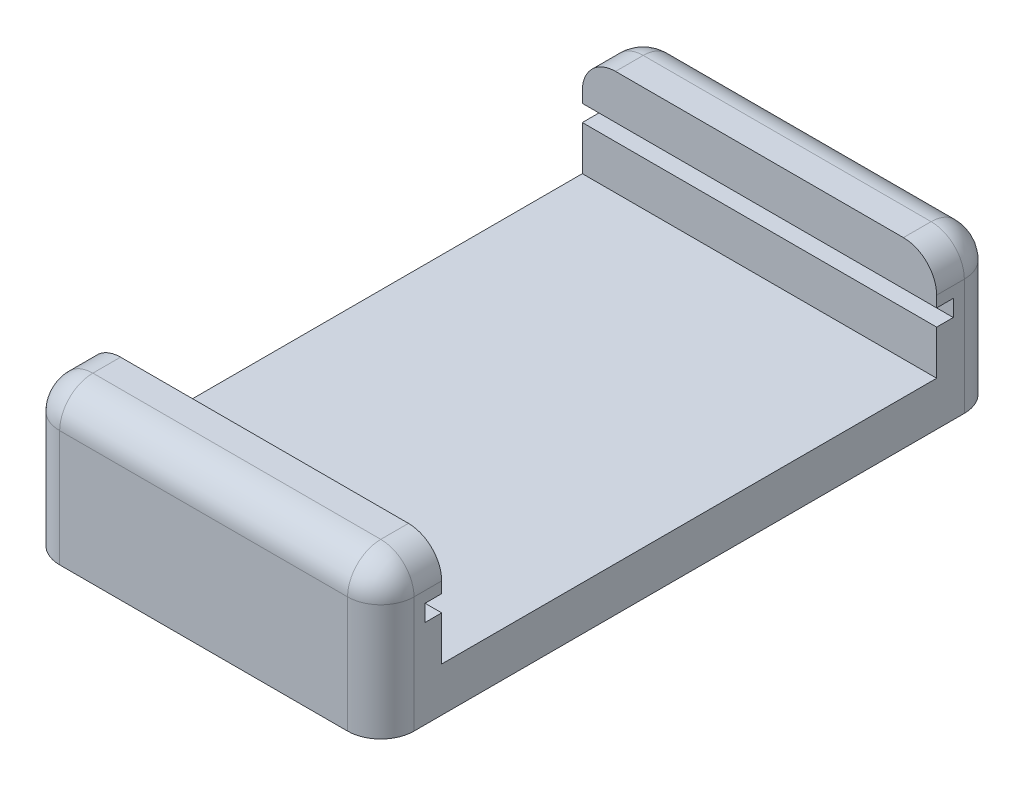
ISO-10303-21;
HEADER;
FILE_DESCRIPTION(('STEP AP214'),'2;1');
FILE_NAME('part.step','',(''),(''),'','','');
FILE_SCHEMA(('AUTOMOTIVE_DESIGN { 1 0 10303 214 1 1 1 1 }'));
ENDSEC;
DATA;
#1=APPLICATION_CONTEXT('core data for automotive mechanical design processes');
#2=APPLICATION_PROTOCOL_DEFINITION('international standard','automotive_design',2000,#1);
#3=PRODUCT_CONTEXT('',#1,'mechanical');
#4=PRODUCT('Part','Part','',(#3));
#5=PRODUCT_RELATED_PRODUCT_CATEGORY('part','',(#4));
#6=PRODUCT_DEFINITION_FORMATION('','',#4);
#7=PRODUCT_DEFINITION_CONTEXT('part definition',#1,'design');
#8=PRODUCT_DEFINITION('design','',#6,#7);
#9=PRODUCT_DEFINITION_SHAPE('','',#8);
#10=(LENGTH_UNIT() NAMED_UNIT(*) SI_UNIT(.MILLI.,.METRE.));
#11=(NAMED_UNIT(*) PLANE_ANGLE_UNIT() SI_UNIT($,.RADIAN.));
#12=(NAMED_UNIT(*) SI_UNIT($,.STERADIAN.) SOLID_ANGLE_UNIT());
#13=UNCERTAINTY_MEASURE_WITH_UNIT(LENGTH_MEASURE(1.E-05),#10,'distance_accuracy_value','');
#14=(GEOMETRIC_REPRESENTATION_CONTEXT(3) GLOBAL_UNCERTAINTY_ASSIGNED_CONTEXT((#13)) GLOBAL_UNIT_ASSIGNED_CONTEXT((#10,
#11,#12)) REPRESENTATION_CONTEXT('',''));
#15=CARTESIAN_POINT('',(0.,0.,0.));
#16=DIRECTION('',(0.,0.,1.));
#17=DIRECTION('',(1.,0.,0.));
#18=AXIS2_PLACEMENT_3D('',#15,#16,#17);
#19=CARTESIAN_POINT('',(64.77,0.,0.));
#20=DIRECTION('',(-1.,0.,0.));
#21=DIRECTION('',(0.,0.,1.));
#22=AXIS2_PLACEMENT_3D('',#19,#20,#21);
#23=PLANE('',#22);
#24=DIRECTION('',(0.,-1.,0.));
#25=VECTOR('',#24,1.);
#26=CARTESIAN_POINT('',(64.77,0.,-86.106));
#27=LINE('',#26,#25);
#28=CARTESIAN_POINT('',(64.77,19.3294,-86.106));
#29=VERTEX_POINT('',#28);
#30=CARTESIAN_POINT('',(64.77,18.0594,-86.106));
#31=VERTEX_POINT('',#30);
#32=EDGE_CURVE('E276',#29,#31,#27,.T.);
#33=ORIENTED_EDGE('',*,*,#32,.F.);
#34=DIRECTION('',(0.,0.,1.));
#35=VECTOR('',#34,1.);
#36=CARTESIAN_POINT('',(64.77,19.3294,-82.931));
#37=LINE('',#36,#35);
#38=CARTESIAN_POINT('',(64.77,19.3294,-82.931));
#39=VERTEX_POINT('',#38);
#40=EDGE_CURVE('E393',#29,#39,#37,.T.);
#41=ORIENTED_EDGE('',*,*,#40,.T.);
#42=DIRECTION('',(0.,1.,0.));
#43=VECTOR('',#42,1.);
#44=CARTESIAN_POINT('',(64.77,0.,-82.931));
#45=LINE('',#44,#43);
#46=CARTESIAN_POINT('',(64.77,5.9944,-82.931));
#47=VERTEX_POINT('',#46);
#48=EDGE_CURVE('E390',#39,#47,#45,.F.);
#49=ORIENTED_EDGE('',*,*,#48,.T.);
#50=DIRECTION('',(0.,0.,-1.));
#51=VECTOR('',#50,1.);
#52=CARTESIAN_POINT('',(64.77,5.9944,0.));
#53=LINE('',#52,#51);
#54=CARTESIAN_POINT('',(64.77,5.9944,-146.05));
#55=VERTEX_POINT('',#54);
#56=EDGE_CURVE('E320',#47,#55,#53,.T.);
#57=ORIENTED_EDGE('',*,*,#56,.T.);
#58=DIRECTION('',(0.,1.,0.));
#59=VECTOR('',#58,1.);
#60=CARTESIAN_POINT('',(64.77,19.3294,-146.05));
#61=LINE('',#60,#59);
#62=CARTESIAN_POINT('',(64.77,19.3294,-146.05));
#63=VERTEX_POINT('',#62);
#64=EDGE_CURVE('E385',#55,#63,#61,.T.);
#65=ORIENTED_EDGE('',*,*,#64,.T.);
#66=DIRECTION('',(0.,0.,1.));
#67=VECTOR('',#66,1.);
#68=CARTESIAN_POINT('',(64.77,19.3294,-142.875));
#69=LINE('',#68,#67);
#70=CARTESIAN_POINT('',(64.77,19.3294,-142.875));
#71=VERTEX_POINT('',#70);
#72=EDGE_CURVE('E387',#63,#71,#69,.T.);
#73=ORIENTED_EDGE('',*,*,#72,.T.);
#74=DIRECTION('',(0.,-1.,0.));
#75=VECTOR('',#74,1.);
#76=CARTESIAN_POINT('',(64.77,0.,-142.875));
#77=LINE('',#76,#75);
#78=CARTESIAN_POINT('',(64.77,18.0594,-142.875));
#79=VERTEX_POINT('',#78);
#80=EDGE_CURVE('E316',#71,#79,#77,.T.);
#81=ORIENTED_EDGE('',*,*,#80,.T.);
#82=DIRECTION('',(0.,0.,1.));
#83=VECTOR('',#82,1.);
#84=CARTESIAN_POINT('',(64.77,18.0594,0.));
#85=LINE('',#84,#83);
#86=CARTESIAN_POINT('',(64.77,18.0594,-144.78));
#87=VERTEX_POINT('',#86);
#88=EDGE_CURVE('E300',#87,#79,#85,.T.);
#89=ORIENTED_EDGE('',*,*,#88,.F.);
#90=DIRECTION('',(0.,-1.,0.));
#91=VECTOR('',#90,1.);
#92=CARTESIAN_POINT('',(64.77,0.,-144.78));
#93=LINE('',#92,#91);
#94=CARTESIAN_POINT('',(64.77,16.1544,-144.78));
#95=VERTEX_POINT('',#94);
#96=EDGE_CURVE('E317',#87,#95,#93,.T.);
#97=ORIENTED_EDGE('',*,*,#96,.T.);
#98=DIRECTION('',(0.,0.,1.));
#99=VECTOR('',#98,1.);
#100=CARTESIAN_POINT('',(64.77,16.1544,0.));
#101=LINE('',#100,#99);
#102=CARTESIAN_POINT('',(64.77,16.1544,-142.875));
#103=VERTEX_POINT('',#102);
#104=EDGE_CURVE('E307',#95,#103,#101,.T.);
#105=ORIENTED_EDGE('',*,*,#104,.T.);
#106=CARTESIAN_POINT('',(64.77,11.0744,-142.875));
#107=VERTEX_POINT('',#106);
#108=EDGE_CURVE('E313',#103,#107,#77,.T.);
#109=ORIENTED_EDGE('',*,*,#108,.T.);
#110=DIRECTION('',(0.,0.,1.));
#111=VECTOR('',#110,1.);
#112=CARTESIAN_POINT('',(64.77,11.0744,0.));
#113=LINE('',#112,#111);
#114=CARTESIAN_POINT('',(64.77,11.0744,-86.106));
#115=VERTEX_POINT('',#114);
#116=EDGE_CURVE('E310',#107,#115,#113,.T.);
#117=ORIENTED_EDGE('',*,*,#116,.T.);
#118=CARTESIAN_POINT('',(64.77,16.1544,-86.106));
#119=VERTEX_POINT('',#118);
#120=EDGE_CURVE('E306',#119,#115,#27,.T.);
#121=ORIENTED_EDGE('',*,*,#120,.F.);
#122=CARTESIAN_POINT('',(64.77,16.1544,-84.201));
#123=VERTEX_POINT('',#122);
#124=EDGE_CURVE('E303',#119,#123,#101,.T.);
#125=ORIENTED_EDGE('',*,*,#124,.T.);
#126=DIRECTION('',(0.,-1.,0.));
#127=VECTOR('',#126,1.);
#128=CARTESIAN_POINT('',(64.77,0.,-84.201));
#129=LINE('',#128,#127);
#130=CARTESIAN_POINT('',(64.77,18.0594,-84.201));
#131=VERTEX_POINT('',#130);
#132=EDGE_CURVE('E299',#131,#123,#129,.T.);
#133=ORIENTED_EDGE('',*,*,#132,.F.);
#134=EDGE_CURVE('E241',#31,#131,#85,.T.);
#135=ORIENTED_EDGE('',*,*,#134,.F.);
#136=EDGE_LOOP('',(#33,#41,#49,#57,#65,#73,#81,#89,#97,#105,#109,#117,#121,#125,#133,#135));
#137=FACE_BOUND('',#136,.T.);
#138=ADVANCED_FACE('F41',(#137),#23,.F.);
#139=CARTESIAN_POINT('',(24.13,0.,0.));
#140=DIRECTION('',(-1.,0.,0.));
#141=DIRECTION('',(0.,0.,1.));
#142=AXIS2_PLACEMENT_3D('',#139,#140,#141);
#143=PLANE('',#142);
#144=DIRECTION('',(0.,1.,0.));
#145=VECTOR('',#144,1.);
#146=CARTESIAN_POINT('',(24.13,19.3294,-82.931));
#147=LINE('',#146,#145);
#148=CARTESIAN_POINT('',(24.13,5.9944,-82.931));
#149=VERTEX_POINT('',#148);
#150=CARTESIAN_POINT('',(24.13,19.3294,-82.931));
#151=VERTEX_POINT('',#150);
#152=EDGE_CURVE('E373',#149,#151,#147,.T.);
#153=ORIENTED_EDGE('',*,*,#152,.T.);
#154=DIRECTION('',(0.,0.,1.));
#155=VECTOR('',#154,1.);
#156=CARTESIAN_POINT('',(24.13,19.3294,0.));
#157=LINE('',#156,#155);
#158=CARTESIAN_POINT('',(24.13,19.3294,-86.106));
#159=VERTEX_POINT('',#158);
#160=EDGE_CURVE('E375',#151,#159,#157,.F.);
#161=ORIENTED_EDGE('',*,*,#160,.T.);
#162=DIRECTION('',(0.,-1.,0.));
#163=VECTOR('',#162,1.);
#164=CARTESIAN_POINT('',(24.13,0.,-86.106));
#165=LINE('',#164,#163);
#166=CARTESIAN_POINT('',(24.13,18.0594,-86.106));
#167=VERTEX_POINT('',#166);
#168=EDGE_CURVE('E286',#159,#167,#165,.T.);
#169=ORIENTED_EDGE('',*,*,#168,.T.);
#170=DIRECTION('',(0.,0.,1.));
#171=VECTOR('',#170,1.);
#172=CARTESIAN_POINT('',(24.13,18.0594,0.));
#173=LINE('',#172,#171);
#174=CARTESIAN_POINT('',(24.13,18.0594,-84.201));
#175=VERTEX_POINT('',#174);
#176=EDGE_CURVE('E272',#167,#175,#173,.T.);
#177=ORIENTED_EDGE('',*,*,#176,.T.);
#178=DIRECTION('',(0.,-1.,0.));
#179=VECTOR('',#178,1.);
#180=CARTESIAN_POINT('',(24.13,0.,-84.201));
#181=LINE('',#180,#179);
#182=CARTESIAN_POINT('',(24.13,16.1544,-84.201));
#183=VERTEX_POINT('',#182);
#184=EDGE_CURVE('E275',#175,#183,#181,.T.);
#185=ORIENTED_EDGE('',*,*,#184,.T.);
#186=DIRECTION('',(0.,0.,1.));
#187=VECTOR('',#186,1.);
#188=CARTESIAN_POINT('',(24.13,16.1544,0.));
#189=LINE('',#188,#187);
#190=CARTESIAN_POINT('',(24.13,16.1544,-86.106));
#191=VERTEX_POINT('',#190);
#192=EDGE_CURVE('E279',#191,#183,#189,.T.);
#193=ORIENTED_EDGE('',*,*,#192,.F.);
#194=CARTESIAN_POINT('',(24.13,11.0744,-86.106));
#195=VERTEX_POINT('',#194);
#196=EDGE_CURVE('E282',#191,#195,#165,.T.);
#197=ORIENTED_EDGE('',*,*,#196,.T.);
#198=DIRECTION('',(0.,0.,1.));
#199=VECTOR('',#198,1.);
#200=CARTESIAN_POINT('',(24.13,11.0744,0.));
#201=LINE('',#200,#199);
#202=CARTESIAN_POINT('',(24.13,11.0744,-142.875));
#203=VERTEX_POINT('',#202);
#204=EDGE_CURVE('E285',#203,#195,#201,.T.);
#205=ORIENTED_EDGE('',*,*,#204,.F.);
#206=DIRECTION('',(0.,-1.,0.));
#207=VECTOR('',#206,1.);
#208=CARTESIAN_POINT('',(24.13,0.,-142.875));
#209=LINE('',#208,#207);
#210=CARTESIAN_POINT('',(24.13,16.1544,-142.875));
#211=VERTEX_POINT('',#210);
#212=EDGE_CURVE('E289',#211,#203,#209,.T.);
#213=ORIENTED_EDGE('',*,*,#212,.F.);
#214=CARTESIAN_POINT('',(24.13,16.1544,-144.78));
#215=VERTEX_POINT('',#214);
#216=EDGE_CURVE('E283',#215,#211,#189,.T.);
#217=ORIENTED_EDGE('',*,*,#216,.F.);
#218=DIRECTION('',(0.,-1.,0.));
#219=VECTOR('',#218,1.);
#220=CARTESIAN_POINT('',(24.13,0.,-144.78));
#221=LINE('',#220,#219);
#222=CARTESIAN_POINT('',(24.13,18.0594,-144.78));
#223=VERTEX_POINT('',#222);
#224=EDGE_CURVE('E293',#223,#215,#221,.T.);
#225=ORIENTED_EDGE('',*,*,#224,.F.);
#226=CARTESIAN_POINT('',(24.13,18.0594,-142.875));
#227=VERTEX_POINT('',#226);
#228=EDGE_CURVE('E277',#223,#227,#173,.T.);
#229=ORIENTED_EDGE('',*,*,#228,.T.);
#230=CARTESIAN_POINT('',(24.13,19.3294,-142.875));
#231=VERTEX_POINT('',#230);
#232=EDGE_CURVE('E292',#231,#227,#209,.T.);
#233=ORIENTED_EDGE('',*,*,#232,.F.);
#234=DIRECTION('',(0.,0.,1.));
#235=VECTOR('',#234,1.);
#236=CARTESIAN_POINT('',(24.13,19.3294,0.));
#237=LINE('',#236,#235);
#238=CARTESIAN_POINT('',(24.13,19.3294,-146.05));
#239=VERTEX_POINT('',#238);
#240=EDGE_CURVE('E371',#231,#239,#237,.F.);
#241=ORIENTED_EDGE('',*,*,#240,.T.);
#242=DIRECTION('',(0.,1.,0.));
#243=VECTOR('',#242,1.);
#244=CARTESIAN_POINT('',(24.13,0.,-146.05));
#245=LINE('',#244,#243);
#246=CARTESIAN_POINT('',(24.13,5.9944,-146.05));
#247=VERTEX_POINT('',#246);
#248=EDGE_CURVE('E369',#239,#247,#245,.F.);
#249=ORIENTED_EDGE('',*,*,#248,.T.);
#250=DIRECTION('',(0.,0.,-1.));
#251=VECTOR('',#250,1.);
#252=CARTESIAN_POINT('',(24.13,5.9944,0.));
#253=LINE('',#252,#251);
#254=EDGE_CURVE('E208',#149,#247,#253,.T.);
#255=ORIENTED_EDGE('',*,*,#254,.F.);
#256=EDGE_LOOP('',(#153,#161,#169,#177,#185,#193,#197,#205,#213,#217,#225,#229,#233,#241,#249,#255));
#257=FACE_BOUND('',#256,.T.);
#258=ADVANCED_FACE('F452',(#257),#143,.T.);
#259=CARTESIAN_POINT('',(24.13,0.,-86.106));
#260=DIRECTION('',(0.,0.,1.));
#261=DIRECTION('',(1.,0.,0.));
#262=AXIS2_PLACEMENT_3D('',#259,#260,#261);
#263=PLANE('',#262);
#264=ORIENTED_EDGE('',*,*,#168,.F.);
#265=CARTESIAN_POINT('',(27.94,19.3294,-86.106));
#266=DIRECTION('',(0.,0.,1.));
#267=DIRECTION('',(1.,0.,0.));
#268=AXIS2_PLACEMENT_3D('',#265,#266,#267);
#269=CIRCLE('',#268,3.81);
#270=CARTESIAN_POINT('',(27.94,23.1394,-86.106));
#271=VERTEX_POINT('',#270);
#272=EDGE_CURVE('E379',#159,#271,#269,.F.);
#273=ORIENTED_EDGE('',*,*,#272,.T.);
#274=DIRECTION('',(1.,0.,0.));
#275=VECTOR('',#274,1.);
#276=CARTESIAN_POINT('',(24.13,23.1394,-86.106));
#277=LINE('',#276,#275);
#278=CARTESIAN_POINT('',(60.96,23.1394,-86.106));
#279=VERTEX_POINT('',#278);
#280=EDGE_CURVE('E326',#271,#279,#277,.T.);
#281=ORIENTED_EDGE('',*,*,#280,.T.);
#282=CARTESIAN_POINT('',(60.96,19.3294,-86.106));
#283=DIRECTION('',(0.,0.,1.));
#284=DIRECTION('',(1.,0.,0.));
#285=AXIS2_PLACEMENT_3D('',#282,#283,#284);
#286=CIRCLE('',#285,3.81);
#287=EDGE_CURVE('E377',#279,#29,#286,.F.);
#288=ORIENTED_EDGE('',*,*,#287,.T.);
#289=ORIENTED_EDGE('',*,*,#32,.T.);
#290=DIRECTION('',(1.,0.,0.));
#291=VECTOR('',#290,1.);
#292=CARTESIAN_POINT('',(24.13,18.0594,-86.106));
#293=LINE('',#292,#291);
#294=EDGE_CURVE('E323',#167,#31,#293,.T.);
#295=ORIENTED_EDGE('',*,*,#294,.F.);
#296=EDGE_LOOP('',(#264,#273,#281,#288,#289,#295));
#297=FACE_BOUND('',#296,.T.);
#298=ADVANCED_FACE('F436',(#297),#263,.F.);
#299=CARTESIAN_POINT('',(24.13,23.1394,0.));
#300=DIRECTION('',(0.,1.,0.));
#301=DIRECTION('',(0.,0.,1.));
#302=AXIS2_PLACEMENT_3D('',#299,#300,#301);
#303=PLANE('',#302);
#304=ORIENTED_EDGE('',*,*,#280,.F.);
#305=DIRECTION('',(0.,0.,1.));
#306=VECTOR('',#305,1.);
#307=CARTESIAN_POINT('',(27.94,23.1394,0.));
#308=LINE('',#307,#306);
#309=CARTESIAN_POINT('',(27.94,23.1394,-82.931));
#310=VERTEX_POINT('',#309);
#311=EDGE_CURVE('E366',#271,#310,#308,.T.);
#312=ORIENTED_EDGE('',*,*,#311,.T.);
#313=DIRECTION('',(1.,0.,0.));
#314=VECTOR('',#313,1.);
#315=CARTESIAN_POINT('',(64.77,23.1394,-82.931));
#316=LINE('',#315,#314);
#317=CARTESIAN_POINT('',(60.96,23.1394,-82.931));
#318=VERTEX_POINT('',#317);
#319=EDGE_CURVE('E353',#310,#318,#316,.T.);
#320=ORIENTED_EDGE('',*,*,#319,.T.);
#321=DIRECTION('',(0.,0.,1.));
#322=VECTOR('',#321,1.);
#323=CARTESIAN_POINT('',(60.96,23.1394,-86.106));
#324=LINE('',#323,#322);
#325=EDGE_CURVE('E364',#318,#279,#324,.F.);
#326=ORIENTED_EDGE('',*,*,#325,.T.);
#327=EDGE_LOOP('',(#304,#312,#320,#326));
#328=FACE_BOUND('',#327,.T.);
#329=ADVANCED_FACE('F432',(#328),#303,.T.);
#330=CARTESIAN_POINT('',(24.13,0.,-79.121));
#331=DIRECTION('',(0.,0.,-1.));
#332=DIRECTION('',(-1.,0.,0.));
#333=AXIS2_PLACEMENT_3D('',#330,#331,#332);
#334=PLANE('',#333);
#335=DIRECTION('',(1.,0.,0.));
#336=VECTOR('',#335,1.);
#337=CARTESIAN_POINT('',(24.13,19.3294,-79.121));
#338=LINE('',#337,#336);
#339=CARTESIAN_POINT('',(60.96,19.3294,-79.121));
#340=VERTEX_POINT('',#339);
#341=CARTESIAN_POINT('',(27.94,19.3294,-79.121));
#342=VERTEX_POINT('',#341);
#343=EDGE_CURVE('E356',#340,#342,#338,.F.);
#344=ORIENTED_EDGE('',*,*,#343,.T.);
#345=DIRECTION('',(0.,1.,0.));
#346=VECTOR('',#345,1.);
#347=CARTESIAN_POINT('',(27.94,5.9944,-79.121));
#348=LINE('',#347,#346);
#349=CARTESIAN_POINT('',(27.94,5.9944,-79.121));
#350=VERTEX_POINT('',#349);
#351=EDGE_CURVE('E222',#342,#350,#348,.F.);
#352=ORIENTED_EDGE('',*,*,#351,.T.);
#353=DIRECTION('',(1.,0.,0.));
#354=VECTOR('',#353,1.);
#355=CARTESIAN_POINT('',(24.13,5.9944,-79.121));
#356=LINE('',#355,#354);
#357=CARTESIAN_POINT('',(60.96,5.9944,-79.121));
#358=VERTEX_POINT('',#357);
#359=EDGE_CURVE('E217',#350,#358,#356,.T.);
#360=ORIENTED_EDGE('',*,*,#359,.T.);
#361=DIRECTION('',(0.,1.,0.));
#362=VECTOR('',#361,1.);
#363=CARTESIAN_POINT('',(60.96,0.,-79.121));
#364=LINE('',#363,#362);
#365=EDGE_CURVE('E227',#358,#340,#364,.T.);
#366=ORIENTED_EDGE('',*,*,#365,.T.);
#367=EDGE_LOOP('',(#344,#352,#360,#366));
#368=FACE_BOUND('',#367,.T.);
#369=ADVANCED_FACE('F410',(#368),#334,.F.);
#370=CARTESIAN_POINT('',(24.13,0.,-149.86));
#371=DIRECTION('',(0.,0.,-1.));
#372=DIRECTION('',(-1.,0.,0.));
#373=AXIS2_PLACEMENT_3D('',#370,#371,#372);
#374=PLANE('',#373);
#375=DIRECTION('',(1.,0.,0.));
#376=VECTOR('',#375,1.);
#377=CARTESIAN_POINT('',(24.13,19.3294,-149.86));
#378=LINE('',#377,#376);
#379=CARTESIAN_POINT('',(27.94,19.3294,-149.86));
#380=VERTEX_POINT('',#379);
#381=CARTESIAN_POINT('',(60.96,19.3294,-149.86));
#382=VERTEX_POINT('',#381);
#383=EDGE_CURVE('E359',#380,#382,#378,.T.);
#384=ORIENTED_EDGE('',*,*,#383,.T.);
#385=DIRECTION('',(0.,1.,0.));
#386=VECTOR('',#385,1.);
#387=CARTESIAN_POINT('',(60.96,5.9944,-149.86));
#388=LINE('',#387,#386);
#389=CARTESIAN_POINT('',(60.96,5.9944,-149.86));
#390=VERTEX_POINT('',#389);
#391=EDGE_CURVE('E214',#382,#390,#388,.F.);
#392=ORIENTED_EDGE('',*,*,#391,.T.);
#393=DIRECTION('',(1.,0.,0.));
#394=VECTOR('',#393,1.);
#395=CARTESIAN_POINT('',(24.13,5.9944,-149.86));
#396=LINE('',#395,#394);
#397=CARTESIAN_POINT('',(27.94,5.9944,-149.86));
#398=VERTEX_POINT('',#397);
#399=EDGE_CURVE('E205',#398,#390,#396,.T.);
#400=ORIENTED_EDGE('',*,*,#399,.F.);
#401=DIRECTION('',(0.,1.,0.));
#402=VECTOR('',#401,1.);
#403=CARTESIAN_POINT('',(27.94,0.,-149.86));
#404=LINE('',#403,#402);
#405=EDGE_CURVE('E65',#398,#380,#404,.T.);
#406=ORIENTED_EDGE('',*,*,#405,.T.);
#407=EDGE_LOOP('',(#384,#392,#400,#406));
#408=FACE_BOUND('',#407,.T.);
#409=ADVANCED_FACE('F212',(#408),#374,.T.);
#410=DIRECTION('',(1.,0.,0.));
#411=VECTOR('',#410,1.);
#412=CARTESIAN_POINT('',(24.13,23.1394,-142.875));
#413=LINE('',#412,#411);
#414=CARTESIAN_POINT('',(27.94,23.1394,-142.875));
#415=VERTEX_POINT('',#414);
#416=CARTESIAN_POINT('',(60.96,23.1394,-142.875));
#417=VERTEX_POINT('',#416);
#418=EDGE_CURVE('E216',#415,#417,#413,.T.);
#419=ORIENTED_EDGE('',*,*,#418,.T.);
#420=DIRECTION('',(0.,0.,1.));
#421=VECTOR('',#420,1.);
#422=CARTESIAN_POINT('',(60.96,23.1394,-146.05));
#423=LINE('',#422,#421);
#424=CARTESIAN_POINT('',(60.96,23.1394,-146.05));
#425=VERTEX_POINT('',#424);
#426=EDGE_CURVE('E403',#417,#425,#423,.F.);
#427=ORIENTED_EDGE('',*,*,#426,.T.);
#428=DIRECTION('',(1.,0.,0.));
#429=VECTOR('',#428,1.);
#430=CARTESIAN_POINT('',(24.13,23.1394,-146.05));
#431=LINE('',#430,#429);
#432=CARTESIAN_POINT('',(27.94,23.1394,-146.05));
#433=VERTEX_POINT('',#432);
#434=EDGE_CURVE('E361',#425,#433,#431,.F.);
#435=ORIENTED_EDGE('',*,*,#434,.T.);
#436=DIRECTION('',(0.,0.,1.));
#437=VECTOR('',#436,1.);
#438=CARTESIAN_POINT('',(27.94,23.1394,0.));
#439=LINE('',#438,#437);
#440=EDGE_CURVE('E400',#433,#415,#439,.T.);
#441=ORIENTED_EDGE('',*,*,#440,.T.);
#442=EDGE_LOOP('',(#419,#427,#435,#441));
#443=FACE_BOUND('',#442,.T.);
#444=ADVANCED_FACE('F458',(#443),#303,.T.);
#445=CARTESIAN_POINT('',(24.13,0.,-142.875));
#446=DIRECTION('',(0.,0.,1.));
#447=DIRECTION('',(1.,0.,0.));
#448=AXIS2_PLACEMENT_3D('',#445,#446,#447);
#449=PLANE('',#448);
#450=ORIENTED_EDGE('',*,*,#80,.F.);
#451=CARTESIAN_POINT('',(60.96,19.3294,-142.875));
#452=DIRECTION('',(0.,0.,1.));
#453=DIRECTION('',(1.,0.,0.));
#454=AXIS2_PLACEMENT_3D('',#451,#452,#453);
#455=CIRCLE('',#454,3.81);
#456=EDGE_CURVE('E398',#71,#417,#455,.T.);
#457=ORIENTED_EDGE('',*,*,#456,.T.);
#458=ORIENTED_EDGE('',*,*,#418,.F.);
#459=CARTESIAN_POINT('',(27.94,19.3294,-142.875));
#460=DIRECTION('',(0.,0.,1.));
#461=DIRECTION('',(1.,0.,0.));
#462=AXIS2_PLACEMENT_3D('',#459,#460,#461);
#463=CIRCLE('',#462,3.81);
#464=EDGE_CURVE('E396',#415,#231,#463,.T.);
#465=ORIENTED_EDGE('',*,*,#464,.T.);
#466=ORIENTED_EDGE('',*,*,#232,.T.);
#467=DIRECTION('',(1.,0.,0.));
#468=VECTOR('',#467,1.);
#469=CARTESIAN_POINT('',(24.13,18.0594,-142.875));
#470=LINE('',#469,#468);
#471=EDGE_CURVE('E333',#227,#79,#470,.T.);
#472=ORIENTED_EDGE('',*,*,#471,.T.);
#473=EDGE_LOOP('',(#450,#457,#458,#465,#466,#472));
#474=FACE_BOUND('',#473,.T.);
#475=ADVANCED_FACE('F515',(#474),#449,.T.);
#476=CARTESIAN_POINT('',(24.13,18.0594,0.));
#477=DIRECTION('',(0.,1.,0.));
#478=DIRECTION('',(0.,0.,1.));
#479=AXIS2_PLACEMENT_3D('',#476,#477,#478);
#480=PLANE('',#479);
#481=ORIENTED_EDGE('',*,*,#88,.T.);
#482=ORIENTED_EDGE('',*,*,#471,.F.);
#483=ORIENTED_EDGE('',*,*,#228,.F.);
#484=DIRECTION('',(1.,0.,0.));
#485=VECTOR('',#484,1.);
#486=CARTESIAN_POINT('',(24.13,18.0594,-144.78));
#487=LINE('',#486,#485);
#488=EDGE_CURVE('E336',#223,#87,#487,.T.);
#489=ORIENTED_EDGE('',*,*,#488,.T.);
#490=EDGE_LOOP('',(#481,#482,#483,#489));
#491=FACE_BOUND('',#490,.T.);
#492=ADVANCED_FACE('F512',(#491),#480,.F.);
#493=CARTESIAN_POINT('',(24.13,0.,-144.78));
#494=DIRECTION('',(0.,0.,1.));
#495=DIRECTION('',(1.,0.,0.));
#496=AXIS2_PLACEMENT_3D('',#493,#494,#495);
#497=PLANE('',#496);
#498=ORIENTED_EDGE('',*,*,#96,.F.);
#499=ORIENTED_EDGE('',*,*,#488,.F.);
#500=ORIENTED_EDGE('',*,*,#224,.T.);
#501=DIRECTION('',(1.,0.,0.));
#502=VECTOR('',#501,1.);
#503=CARTESIAN_POINT('',(24.13,16.1544,-144.78));
#504=LINE('',#503,#502);
#505=EDGE_CURVE('E338',#215,#95,#504,.T.);
#506=ORIENTED_EDGE('',*,*,#505,.T.);
#507=EDGE_LOOP('',(#498,#499,#500,#506));
#508=FACE_BOUND('',#507,.T.);
#509=ADVANCED_FACE('F506',(#508),#497,.T.);
#510=CARTESIAN_POINT('',(24.13,16.1544,0.));
#511=DIRECTION('',(0.,1.,0.));
#512=DIRECTION('',(0.,0.,1.));
#513=AXIS2_PLACEMENT_3D('',#510,#511,#512);
#514=PLANE('',#513);
#515=ORIENTED_EDGE('',*,*,#104,.F.);
#516=ORIENTED_EDGE('',*,*,#505,.F.);
#517=ORIENTED_EDGE('',*,*,#216,.T.);
#518=DIRECTION('',(1.,0.,0.));
#519=VECTOR('',#518,1.);
#520=CARTESIAN_POINT('',(24.13,16.1544,-142.875));
#521=LINE('',#520,#519);
#522=EDGE_CURVE('E340',#211,#103,#521,.T.);
#523=ORIENTED_EDGE('',*,*,#522,.T.);
#524=EDGE_LOOP('',(#515,#516,#517,#523));
#525=FACE_BOUND('',#524,.T.);
#526=ADVANCED_FACE('F501',(#525),#514,.T.);
#527=ORIENTED_EDGE('',*,*,#108,.F.);
#528=ORIENTED_EDGE('',*,*,#522,.F.);
#529=ORIENTED_EDGE('',*,*,#212,.T.);
#530=DIRECTION('',(1.,0.,0.));
#531=VECTOR('',#530,1.);
#532=CARTESIAN_POINT('',(24.13,11.0744,-142.875));
#533=LINE('',#532,#531);
#534=EDGE_CURVE('E342',#203,#107,#533,.T.);
#535=ORIENTED_EDGE('',*,*,#534,.T.);
#536=EDGE_LOOP('',(#527,#528,#529,#535));
#537=FACE_BOUND('',#536,.T.);
#538=ADVANCED_FACE('F496',(#537),#449,.T.);
#539=CARTESIAN_POINT('',(24.13,11.0744,0.));
#540=DIRECTION('',(0.,1.,0.));
#541=DIRECTION('',(0.,0.,1.));
#542=AXIS2_PLACEMENT_3D('',#539,#540,#541);
#543=PLANE('',#542);
#544=ORIENTED_EDGE('',*,*,#116,.F.);
#545=ORIENTED_EDGE('',*,*,#534,.F.);
#546=ORIENTED_EDGE('',*,*,#204,.T.);
#547=DIRECTION('',(1.,0.,0.));
#548=VECTOR('',#547,1.);
#549=CARTESIAN_POINT('',(24.13,11.0744,-86.106));
#550=LINE('',#549,#548);
#551=EDGE_CURVE('E344',#195,#115,#550,.T.);
#552=ORIENTED_EDGE('',*,*,#551,.T.);
#553=EDGE_LOOP('',(#544,#545,#546,#552));
#554=FACE_BOUND('',#553,.T.);
#555=ADVANCED_FACE('F551',(#554),#543,.T.);
#556=ORIENTED_EDGE('',*,*,#120,.T.);
#557=ORIENTED_EDGE('',*,*,#551,.F.);
#558=ORIENTED_EDGE('',*,*,#196,.F.);
#559=DIRECTION('',(1.,0.,0.));
#560=VECTOR('',#559,1.);
#561=CARTESIAN_POINT('',(24.13,16.1544,-86.106));
#562=LINE('',#561,#560);
#563=EDGE_CURVE('E346',#191,#119,#562,.T.);
#564=ORIENTED_EDGE('',*,*,#563,.T.);
#565=EDGE_LOOP('',(#556,#557,#558,#564));
#566=FACE_BOUND('',#565,.T.);
#567=ADVANCED_FACE('F488',(#566),#263,.F.);
#568=ORIENTED_EDGE('',*,*,#124,.F.);
#569=ORIENTED_EDGE('',*,*,#563,.F.);
#570=ORIENTED_EDGE('',*,*,#192,.T.);
#571=DIRECTION('',(1.,0.,0.));
#572=VECTOR('',#571,1.);
#573=CARTESIAN_POINT('',(24.13,16.1544,-84.201));
#574=LINE('',#573,#572);
#575=EDGE_CURVE('E348',#183,#123,#574,.T.);
#576=ORIENTED_EDGE('',*,*,#575,.T.);
#577=EDGE_LOOP('',(#568,#569,#570,#576));
#578=FACE_BOUND('',#577,.T.);
#579=ADVANCED_FACE('F483',(#578),#514,.T.);
#580=CARTESIAN_POINT('',(24.13,0.,-84.201));
#581=DIRECTION('',(0.,0.,1.));
#582=DIRECTION('',(1.,0.,0.));
#583=AXIS2_PLACEMENT_3D('',#580,#581,#582);
#584=PLANE('',#583);
#585=ORIENTED_EDGE('',*,*,#132,.T.);
#586=ORIENTED_EDGE('',*,*,#575,.F.);
#587=ORIENTED_EDGE('',*,*,#184,.F.);
#588=DIRECTION('',(1.,0.,0.));
#589=VECTOR('',#588,1.);
#590=CARTESIAN_POINT('',(24.13,18.0594,-84.201));
#591=LINE('',#590,#589);
#592=EDGE_CURVE('E350',#175,#131,#591,.T.);
#593=ORIENTED_EDGE('',*,*,#592,.T.);
#594=EDGE_LOOP('',(#585,#586,#587,#593));
#595=FACE_BOUND('',#594,.T.);
#596=ADVANCED_FACE('F480',(#595),#584,.F.);
#597=ORIENTED_EDGE('',*,*,#134,.T.);
#598=ORIENTED_EDGE('',*,*,#592,.F.);
#599=ORIENTED_EDGE('',*,*,#176,.F.);
#600=ORIENTED_EDGE('',*,*,#294,.T.);
#601=EDGE_LOOP('',(#597,#598,#599,#600));
#602=FACE_BOUND('',#601,.T.);
#603=ADVANCED_FACE('F475',(#602),#480,.F.);
#604=CARTESIAN_POINT('',(24.13,19.3294,-82.931));
#605=DIRECTION('',(-1.,0.,0.));
#606=DIRECTION('',(0.,0.,1.));
#607=AXIS2_PLACEMENT_3D('',#604,#605,#606);
#608=CYLINDRICAL_SURFACE('',#607,3.81);
#609=ORIENTED_EDGE('',*,*,#319,.F.);
#610=CARTESIAN_POINT('',(27.94,19.3294,-82.931));
#611=DIRECTION('',(-1.,0.,0.));
#612=DIRECTION('',(0.,0.,1.));
#613=AXIS2_PLACEMENT_3D('',#610,#611,#612);
#614=CIRCLE('',#613,3.81);
#615=EDGE_CURVE('E383',#310,#342,#614,.F.);
#616=ORIENTED_EDGE('',*,*,#615,.T.);
#617=ORIENTED_EDGE('',*,*,#343,.F.);
#618=CARTESIAN_POINT('',(60.96,19.3294,-82.931));
#619=DIRECTION('',(-1.,0.,0.));
#620=DIRECTION('',(0.,0.,1.));
#621=AXIS2_PLACEMENT_3D('',#618,#619,#620);
#622=CIRCLE('',#621,3.81);
#623=EDGE_CURVE('E381',#340,#318,#622,.T.);
#624=ORIENTED_EDGE('',*,*,#623,.T.);
#625=EDGE_LOOP('',(#609,#616,#617,#624));
#626=FACE_BOUND('',#625,.T.);
#627=ADVANCED_FACE('F417',(#626),#608,.T.);
#628=CARTESIAN_POINT('',(24.13,19.3294,-146.05));
#629=DIRECTION('',(1.,0.,0.));
#630=DIRECTION('',(0.,0.,-1.));
#631=AXIS2_PLACEMENT_3D('',#628,#629,#630);
#632=CYLINDRICAL_SURFACE('',#631,3.81);
#633=ORIENTED_EDGE('',*,*,#434,.F.);
#634=CARTESIAN_POINT('',(60.96,19.3294,-146.05));
#635=DIRECTION('',(1.,0.,0.));
#636=DIRECTION('',(0.,0.,-1.));
#637=AXIS2_PLACEMENT_3D('',#634,#635,#636);
#638=CIRCLE('',#637,3.81);
#639=EDGE_CURVE('E58',#425,#382,#638,.F.);
#640=ORIENTED_EDGE('',*,*,#639,.T.);
#641=ORIENTED_EDGE('',*,*,#383,.F.);
#642=CARTESIAN_POINT('',(27.94,19.3294,-146.05));
#643=DIRECTION('',(1.,0.,0.));
#644=DIRECTION('',(0.,0.,-1.));
#645=AXIS2_PLACEMENT_3D('',#642,#643,#644);
#646=CIRCLE('',#645,3.81);
#647=EDGE_CURVE('E405',#380,#433,#646,.T.);
#648=ORIENTED_EDGE('',*,*,#647,.T.);
#649=EDGE_LOOP('',(#633,#640,#641,#648));
#650=FACE_BOUND('',#649,.T.);
#651=ADVANCED_FACE('F456',(#650),#632,.T.);
#652=CARTESIAN_POINT('',(27.94,0.,-82.931));
#653=DIRECTION('',(0.,-1.,0.));
#654=DIRECTION('',(1.,0.,0.));
#655=AXIS2_PLACEMENT_3D('',#652,#653,#654);
#656=CYLINDRICAL_SURFACE('',#655,3.81);
#657=CARTESIAN_POINT('',(27.94,5.9944,-82.931));
#658=DIRECTION('',(0.,-1.,0.));
#659=DIRECTION('',(0.,0.,-1.));
#660=AXIS2_PLACEMENT_3D('',#657,#658,#659);
#661=CIRCLE('',#660,3.81);
#662=EDGE_CURVE('E224',#350,#149,#661,.T.);
#663=ORIENTED_EDGE('',*,*,#662,.F.);
#664=ORIENTED_EDGE('',*,*,#351,.F.);
#665=CARTESIAN_POINT('',(27.94,19.3294,-82.931));
#666=DIRECTION('',(0.,1.,0.));
#667=DIRECTION('',(0.,0.,1.));
#668=AXIS2_PLACEMENT_3D('',#665,#666,#667);
#669=CIRCLE('',#668,3.81);
#670=EDGE_CURVE('E237',#151,#342,#669,.T.);
#671=ORIENTED_EDGE('',*,*,#670,.F.);
#672=ORIENTED_EDGE('',*,*,#152,.F.);
#673=EDGE_LOOP('',(#663,#664,#671,#672));
#674=FACE_BOUND('',#673,.T.);
#675=ADVANCED_FACE('F450',(#674),#656,.T.);
#676=CARTESIAN_POINT('',(27.94,19.3294,-82.931));
#677=DIRECTION('',(-1.,0.,0.));
#678=DIRECTION('',(0.,0.,1.));
#679=AXIS2_PLACEMENT_3D('',#676,#677,#678);
#680=SPHERICAL_SURFACE('',#679,3.81);
#681=ORIENTED_EDGE('',*,*,#670,.T.);
#682=ORIENTED_EDGE('',*,*,#615,.F.);
#683=CARTESIAN_POINT('',(27.94,19.3294,-82.931));
#684=DIRECTION('',(0.,0.,-1.));
#685=DIRECTION('',(-1.,0.,0.));
#686=AXIS2_PLACEMENT_3D('',#683,#684,#685);
#687=CIRCLE('',#686,3.81);
#688=EDGE_CURVE('E235',#151,#310,#687,.T.);
#689=ORIENTED_EDGE('',*,*,#688,.F.);
#690=EDGE_LOOP('',(#681,#682,#689));
#691=FACE_BOUND('',#690,.T.);
#692=ADVANCED_FACE('F445',(#691),#680,.T.);
#693=CARTESIAN_POINT('',(27.94,19.3294,0.));
#694=DIRECTION('',(0.,0.,1.));
#695=DIRECTION('',(1.,0.,0.));
#696=AXIS2_PLACEMENT_3D('',#693,#694,#695);
#697=CYLINDRICAL_SURFACE('',#696,3.81);
#698=ORIENTED_EDGE('',*,*,#272,.F.);
#699=ORIENTED_EDGE('',*,*,#160,.F.);
#700=ORIENTED_EDGE('',*,*,#688,.T.);
#701=ORIENTED_EDGE('',*,*,#311,.F.);
#702=EDGE_LOOP('',(#698,#699,#700,#701));
#703=FACE_BOUND('',#702,.T.);
#704=ADVANCED_FACE('F442',(#703),#697,.T.);
#705=CARTESIAN_POINT('',(60.96,0.,-82.931));
#706=DIRECTION('',(0.,1.,0.));
#707=DIRECTION('',(-1.,0.,0.));
#708=AXIS2_PLACEMENT_3D('',#705,#706,#707);
#709=CYLINDRICAL_SURFACE('',#708,3.81);
#710=CARTESIAN_POINT('',(60.96,19.3294,-82.931));
#711=DIRECTION('',(0.,1.,0.));
#712=DIRECTION('',(0.,0.,1.));
#713=AXIS2_PLACEMENT_3D('',#710,#711,#712);
#714=CIRCLE('',#713,3.81);
#715=EDGE_CURVE('E238',#340,#39,#714,.T.);
#716=ORIENTED_EDGE('',*,*,#715,.F.);
#717=ORIENTED_EDGE('',*,*,#365,.F.);
#718=CARTESIAN_POINT('',(60.96,5.9944,-82.931));
#719=DIRECTION('',(0.,-1.,0.));
#720=DIRECTION('',(0.,0.,-1.));
#721=AXIS2_PLACEMENT_3D('',#718,#719,#720);
#722=CIRCLE('',#721,3.81);
#723=EDGE_CURVE('E232',#47,#358,#722,.T.);
#724=ORIENTED_EDGE('',*,*,#723,.F.);
#725=ORIENTED_EDGE('',*,*,#48,.F.);
#726=EDGE_LOOP('',(#716,#717,#724,#725));
#727=FACE_BOUND('',#726,.T.);
#728=ADVANCED_FACE('F421',(#727),#709,.T.);
#729=CARTESIAN_POINT('',(60.96,19.3294,-82.931));
#730=DIRECTION('',(-1.,0.,0.));
#731=DIRECTION('',(0.,0.,1.));
#732=AXIS2_PLACEMENT_3D('',#729,#730,#731);
#733=SPHERICAL_SURFACE('',#732,3.81);
#734=ORIENTED_EDGE('',*,*,#623,.F.);
#735=ORIENTED_EDGE('',*,*,#715,.T.);
#736=CARTESIAN_POINT('',(60.96,19.3294,-82.931));
#737=DIRECTION('',(0.,0.,-1.));
#738=DIRECTION('',(-1.,0.,0.));
#739=AXIS2_PLACEMENT_3D('',#736,#737,#738);
#740=CIRCLE('',#739,3.81);
#741=EDGE_CURVE('E242',#318,#39,#740,.T.);
#742=ORIENTED_EDGE('',*,*,#741,.F.);
#743=EDGE_LOOP('',(#734,#735,#742));
#744=FACE_BOUND('',#743,.T.);
#745=ADVANCED_FACE('F424',(#744),#733,.T.);
#746=CARTESIAN_POINT('',(60.96,19.3294,0.));
#747=DIRECTION('',(0.,0.,-1.));
#748=DIRECTION('',(-1.,0.,0.));
#749=AXIS2_PLACEMENT_3D('',#746,#747,#748);
#750=CYLINDRICAL_SURFACE('',#749,3.81);
#751=ORIENTED_EDGE('',*,*,#287,.F.);
#752=ORIENTED_EDGE('',*,*,#325,.F.);
#753=ORIENTED_EDGE('',*,*,#741,.T.);
#754=ORIENTED_EDGE('',*,*,#40,.F.);
#755=EDGE_LOOP('',(#751,#752,#753,#754));
#756=FACE_BOUND('',#755,.T.);
#757=ADVANCED_FACE('F429',(#756),#750,.T.);
#758=CARTESIAN_POINT('',(60.96,0.,-146.05));
#759=DIRECTION('',(0.,-1.,0.));
#760=DIRECTION('',(1.,0.,0.));
#761=AXIS2_PLACEMENT_3D('',#758,#759,#760);
#762=CYLINDRICAL_SURFACE('',#761,3.81);
#763=CARTESIAN_POINT('',(60.96,5.9944,-146.05));
#764=DIRECTION('',(0.,-1.,0.));
#765=DIRECTION('',(0.,0.,-1.));
#766=AXIS2_PLACEMENT_3D('',#763,#764,#765);
#767=CIRCLE('',#766,3.81);
#768=EDGE_CURVE('E50',#390,#55,#767,.T.);
#769=ORIENTED_EDGE('',*,*,#768,.F.);
#770=ORIENTED_EDGE('',*,*,#391,.F.);
#771=CARTESIAN_POINT('',(60.96,19.3294,-146.05));
#772=DIRECTION('',(0.,1.,0.));
#773=DIRECTION('',(0.,0.,1.));
#774=AXIS2_PLACEMENT_3D('',#771,#772,#773);
#775=CIRCLE('',#774,3.81);
#776=EDGE_CURVE('E244',#63,#382,#775,.T.);
#777=ORIENTED_EDGE('',*,*,#776,.F.);
#778=ORIENTED_EDGE('',*,*,#64,.F.);
#779=EDGE_LOOP('',(#769,#770,#777,#778));
#780=FACE_BOUND('',#779,.T.);
#781=ADVANCED_FACE('F470',(#780),#762,.T.);
#782=CARTESIAN_POINT('',(60.96,19.3294,-146.05));
#783=DIRECTION('',(-1.,0.,0.));
#784=DIRECTION('',(0.,0.,1.));
#785=AXIS2_PLACEMENT_3D('',#782,#783,#784);
#786=SPHERICAL_SURFACE('',#785,3.81);
#787=ORIENTED_EDGE('',*,*,#776,.T.);
#788=ORIENTED_EDGE('',*,*,#639,.F.);
#789=CARTESIAN_POINT('',(60.96,19.3294,-146.05));
#790=DIRECTION('',(0.,0.,1.));
#791=DIRECTION('',(1.,0.,0.));
#792=AXIS2_PLACEMENT_3D('',#789,#790,#791);
#793=CIRCLE('',#792,3.81);
#794=EDGE_CURVE('E247',#63,#425,#793,.T.);
#795=ORIENTED_EDGE('',*,*,#794,.F.);
#796=EDGE_LOOP('',(#787,#788,#795));
#797=FACE_BOUND('',#796,.T.);
#798=ADVANCED_FACE('F466',(#797),#786,.T.);
#799=CARTESIAN_POINT('',(60.96,19.3294,0.));
#800=DIRECTION('',(0.,0.,-1.));
#801=DIRECTION('',(-1.,0.,0.));
#802=AXIS2_PLACEMENT_3D('',#799,#800,#801);
#803=CYLINDRICAL_SURFACE('',#802,3.81);
#804=ORIENTED_EDGE('',*,*,#794,.T.);
#805=ORIENTED_EDGE('',*,*,#426,.F.);
#806=ORIENTED_EDGE('',*,*,#456,.F.);
#807=ORIENTED_EDGE('',*,*,#72,.F.);
#808=EDGE_LOOP('',(#804,#805,#806,#807));
#809=FACE_BOUND('',#808,.T.);
#810=ADVANCED_FACE('F462',(#809),#803,.T.);
#811=CARTESIAN_POINT('',(27.94,0.,-146.05));
#812=DIRECTION('',(0.,1.,0.));
#813=DIRECTION('',(-1.,0.,0.));
#814=AXIS2_PLACEMENT_3D('',#811,#812,#813);
#815=CYLINDRICAL_SURFACE('',#814,3.81);
#816=CARTESIAN_POINT('',(27.94,19.3294,-146.05));
#817=DIRECTION('',(0.,1.,0.));
#818=DIRECTION('',(0.,0.,1.));
#819=AXIS2_PLACEMENT_3D('',#816,#817,#818);
#820=CIRCLE('',#819,3.81);
#821=EDGE_CURVE('E45',#380,#239,#820,.T.);
#822=ORIENTED_EDGE('',*,*,#821,.F.);
#823=ORIENTED_EDGE('',*,*,#405,.F.);
#824=CARTESIAN_POINT('',(27.94,5.9944,-146.05));
#825=DIRECTION('',(0.,-1.,0.));
#826=DIRECTION('',(0.,0.,-1.));
#827=AXIS2_PLACEMENT_3D('',#824,#825,#826);
#828=CIRCLE('',#827,3.81);
#829=EDGE_CURVE('E11',#247,#398,#828,.T.);
#830=ORIENTED_EDGE('',*,*,#829,.F.);
#831=ORIENTED_EDGE('',*,*,#248,.F.);
#832=EDGE_LOOP('',(#822,#823,#830,#831));
#833=FACE_BOUND('',#832,.T.);
#834=ADVANCED_FACE('F43',(#833),#815,.T.);
#835=CARTESIAN_POINT('',(27.94,19.3294,-146.05));
#836=DIRECTION('',(-1.,0.,0.));
#837=DIRECTION('',(0.,0.,1.));
#838=AXIS2_PLACEMENT_3D('',#835,#836,#837);
#839=SPHERICAL_SURFACE('',#838,3.81);
#840=ORIENTED_EDGE('',*,*,#647,.F.);
#841=ORIENTED_EDGE('',*,*,#821,.T.);
#842=CARTESIAN_POINT('',(27.94,19.3294,-146.05));
#843=DIRECTION('',(0.,0.,1.));
#844=DIRECTION('',(1.,0.,0.));
#845=AXIS2_PLACEMENT_3D('',#842,#843,#844);
#846=CIRCLE('',#845,3.81);
#847=EDGE_CURVE('E251',#433,#239,#846,.T.);
#848=ORIENTED_EDGE('',*,*,#847,.F.);
#849=EDGE_LOOP('',(#840,#841,#848));
#850=FACE_BOUND('',#849,.T.);
#851=ADVANCED_FACE('F455',(#850),#839,.T.);
#852=CARTESIAN_POINT('',(27.94,19.3294,0.));
#853=DIRECTION('',(0.,0.,1.));
#854=DIRECTION('',(1.,0.,0.));
#855=AXIS2_PLACEMENT_3D('',#852,#853,#854);
#856=CYLINDRICAL_SURFACE('',#855,3.81);
#857=ORIENTED_EDGE('',*,*,#847,.T.);
#858=ORIENTED_EDGE('',*,*,#240,.F.);
#859=ORIENTED_EDGE('',*,*,#464,.F.);
#860=ORIENTED_EDGE('',*,*,#440,.F.);
#861=EDGE_LOOP('',(#857,#858,#859,#860));
#862=FACE_BOUND('',#861,.T.);
#863=ADVANCED_FACE('F516',(#862),#856,.T.);
#864=CARTESIAN_POINT('',(24.13,5.9944,0.));
#865=DIRECTION('',(0.,-1.,0.));
#866=DIRECTION('',(0.,0.,-1.));
#867=AXIS2_PLACEMENT_3D('',#864,#865,#866);
#868=PLANE('',#867);
#869=CARTESIAN_POINT('',(44.45,5.9944,-89.0905));
#870=DIRECTION('',(0.,-1.,0.));
#871=DIRECTION('',(0.,0.,-1.));
#872=AXIS2_PLACEMENT_3D('',#869,#870,#871);
#873=CIRCLE('',#872,2.7305);
#874=CARTESIAN_POINT('',(44.45,5.9944,-91.821));
#875=VERTEX_POINT('',#874);
#876=EDGE_CURVE('E259',#875,#875,#873,.T.);
#877=ORIENTED_EDGE('',*,*,#876,.F.);
#878=EDGE_LOOP('',(#877));
#879=FACE_BOUND('',#878,.T.);
#880=CARTESIAN_POINT('',(44.45,5.9944,-139.8905));
#881=DIRECTION('',(0.,-1.,0.));
#882=DIRECTION('',(0.,0.,-1.));
#883=AXIS2_PLACEMENT_3D('',#880,#881,#882);
#884=CIRCLE('',#883,2.7305);
#885=CARTESIAN_POINT('',(44.45,5.9944,-142.621));
#886=VERTEX_POINT('',#885);
#887=EDGE_CURVE('E264',#886,#886,#884,.T.);
#888=ORIENTED_EDGE('',*,*,#887,.F.);
#889=EDGE_LOOP('',(#888));
#890=FACE_BOUND('',#889,.T.);
#891=ORIENTED_EDGE('',*,*,#359,.F.);
#892=ORIENTED_EDGE('',*,*,#662,.T.);
#893=ORIENTED_EDGE('',*,*,#254,.T.);
#894=ORIENTED_EDGE('',*,*,#829,.T.);
#895=ORIENTED_EDGE('',*,*,#399,.T.);
#896=ORIENTED_EDGE('',*,*,#768,.T.);
#897=ORIENTED_EDGE('',*,*,#56,.F.);
#898=ORIENTED_EDGE('',*,*,#723,.T.);
#899=EDGE_LOOP('',(#891,#892,#893,#894,#895,#896,#897,#898));
#900=FACE_BOUND('',#899,.T.);
#901=ADVANCED_FACE('F204',(#879,#890,#900),#868,.T.);
#902=CARTESIAN_POINT('',(44.45,10.0584,-139.8905));
#903=DIRECTION('',(0.,-1.,0.));
#904=DIRECTION('',(0.,0.,-1.));
#905=AXIS2_PLACEMENT_3D('',#902,#903,#904);
#906=CYLINDRICAL_SURFACE('',#905,2.7305);
#907=CARTESIAN_POINT('',(44.45,10.0584,-139.8905));
#908=DIRECTION('',(0.,-1.,0.));
#909=DIRECTION('',(0.,0.,-1.));
#910=AXIS2_PLACEMENT_3D('',#907,#908,#909);
#911=CIRCLE('',#910,2.7305);
#912=CARTESIAN_POINT('',(44.45,10.0584,-142.621));
#913=VERTEX_POINT('',#912);
#914=EDGE_CURVE('E269',#913,#913,#911,.T.);
#915=ORIENTED_EDGE('',*,*,#914,.F.);
#916=EDGE_LOOP('',(#915));
#917=FACE_BOUND('',#916,.T.);
#918=ORIENTED_EDGE('',*,*,#887,.T.);
#919=EDGE_LOOP('',(#918));
#920=FACE_BOUND('',#919,.T.);
#921=ADVANCED_FACE('F523',(#917,#920),#906,.F.);
#922=CARTESIAN_POINT('',(44.45,10.0584,-139.8905));
#923=DIRECTION('',(0.,-1.,0.));
#924=DIRECTION('',(0.,0.,-1.));
#925=AXIS2_PLACEMENT_3D('',#922,#923,#924);
#926=PLANE('',#925);
#927=ORIENTED_EDGE('',*,*,#914,.T.);
#928=EDGE_LOOP('',(#927));
#929=FACE_BOUND('',#928,.T.);
#930=ADVANCED_FACE('F699',(#929),#926,.T.);
#931=CARTESIAN_POINT('',(44.45,10.0584,-89.0905));
#932=DIRECTION('',(0.,-1.,0.));
#933=DIRECTION('',(0.,0.,-1.));
#934=AXIS2_PLACEMENT_3D('',#931,#932,#933);
#935=CYLINDRICAL_SURFACE('',#934,2.7305);
#936=CARTESIAN_POINT('',(44.45,10.0584,-89.0905));
#937=DIRECTION('',(0.,-1.,0.));
#938=DIRECTION('',(0.,0.,-1.));
#939=AXIS2_PLACEMENT_3D('',#936,#937,#938);
#940=CIRCLE('',#939,2.7305);
#941=CARTESIAN_POINT('',(44.45,10.0584,-91.821));
#942=VERTEX_POINT('',#941);
#943=EDGE_CURVE('E253',#942,#942,#940,.T.);
#944=ORIENTED_EDGE('',*,*,#943,.F.);
#945=EDGE_LOOP('',(#944));
#946=FACE_BOUND('',#945,.T.);
#947=ORIENTED_EDGE('',*,*,#876,.T.);
#948=EDGE_LOOP('',(#947));
#949=FACE_BOUND('',#948,.T.);
#950=ADVANCED_FACE('F709',(#946,#949),#935,.F.);
#951=CARTESIAN_POINT('',(44.45,10.0584,-89.0905));
#952=DIRECTION('',(0.,-1.,0.));
#953=DIRECTION('',(0.,0.,-1.));
#954=AXIS2_PLACEMENT_3D('',#951,#952,#953);
#955=PLANE('',#954);
#956=ORIENTED_EDGE('',*,*,#943,.T.);
#957=EDGE_LOOP('',(#956));
#958=FACE_BOUND('',#957,.T.);
#959=ADVANCED_FACE('F718',(#958),#955,.T.);
#960=CLOSED_SHELL('',(#138,#258,#298,#329,#369,#409,#444,#475,#492,#509,#526,#538,#555,#567,
#579,#596,#603,#627,#651,#675,#692,#704,#728,#745,#757,#781,#798,#810,#834,#851,#863,#901,#921,
#930,#950,#959));
#961=MANIFOLD_SOLID_BREP('B2',#960);
#962=ADVANCED_BREP_SHAPE_REPRESENTATION('',(#18,#961),#14);
#963=SHAPE_DEFINITION_REPRESENTATION(#9,#962);
ENDSEC;
END-ISO-10303-21;
